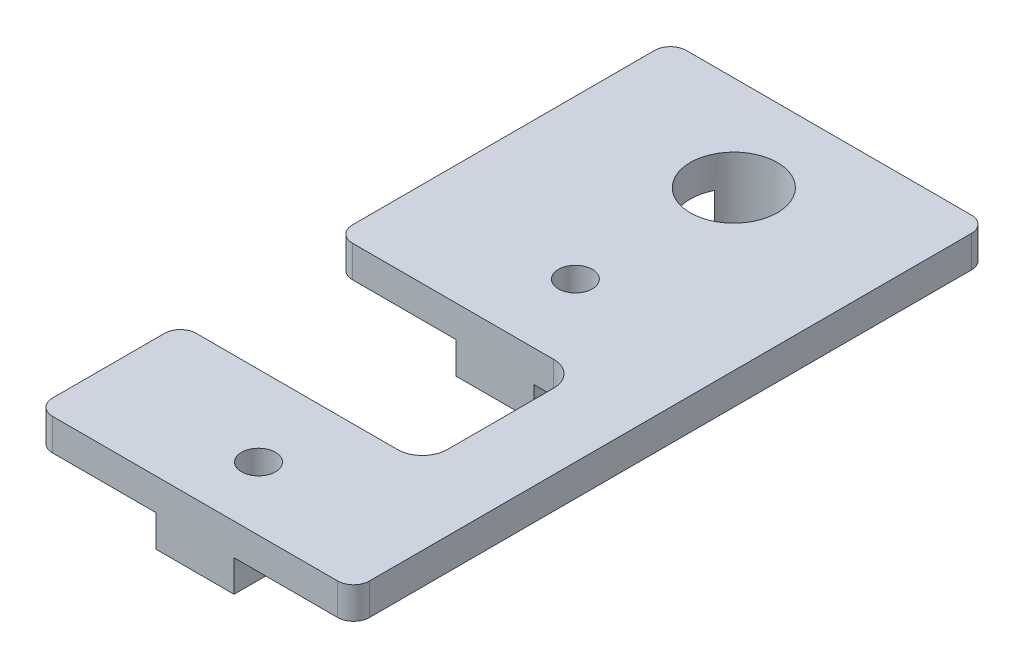
ISO-10303-21;
HEADER;
FILE_DESCRIPTION(('STEP AP214'),'2;1');
FILE_NAME('part.step','',(''),(''),'','','');
FILE_SCHEMA(('AUTOMOTIVE_DESIGN { 1 0 10303 214 1 1 1 1 }'));
ENDSEC;
DATA;
#1=APPLICATION_CONTEXT('core data for automotive mechanical design processes');
#2=APPLICATION_PROTOCOL_DEFINITION('international standard','automotive_design',2000,#1);
#3=PRODUCT_CONTEXT('',#1,'mechanical');
#4=PRODUCT('Part','Part','',(#3));
#5=PRODUCT_RELATED_PRODUCT_CATEGORY('part','',(#4));
#6=PRODUCT_DEFINITION_FORMATION('','',#4);
#7=PRODUCT_DEFINITION_CONTEXT('part definition',#1,'design');
#8=PRODUCT_DEFINITION('design','',#6,#7);
#9=PRODUCT_DEFINITION_SHAPE('','',#8);
#10=(LENGTH_UNIT() NAMED_UNIT(*) SI_UNIT(.MILLI.,.METRE.));
#11=(NAMED_UNIT(*) PLANE_ANGLE_UNIT() SI_UNIT($,.RADIAN.));
#12=(NAMED_UNIT(*) SI_UNIT($,.STERADIAN.) SOLID_ANGLE_UNIT());
#13=UNCERTAINTY_MEASURE_WITH_UNIT(LENGTH_MEASURE(1.E-05),#10,'distance_accuracy_value','');
#14=(GEOMETRIC_REPRESENTATION_CONTEXT(3) GLOBAL_UNCERTAINTY_ASSIGNED_CONTEXT((#13)) GLOBAL_UNIT_ASSIGNED_CONTEXT((#10,
#11,#12)) REPRESENTATION_CONTEXT('',''));
#15=CARTESIAN_POINT('',(0.,0.,0.));
#16=DIRECTION('',(0.,0.,1.));
#17=DIRECTION('',(1.,0.,0.));
#18=AXIS2_PLACEMENT_3D('',#15,#16,#17);
#19=CARTESIAN_POINT('',(-19.775,0.,63.5));
#20=DIRECTION('',(-1.,0.,0.));
#21=DIRECTION('',(0.,0.,-1.));
#22=AXIS2_PLACEMENT_3D('',#19,#20,#21);
#23=PLANE('',#22);
#24=DIRECTION('',(0.,1.,0.));
#25=VECTOR('',#24,1.);
#26=CARTESIAN_POINT('',(-19.775,-3.175,7.5631942908063));
#27=LINE('',#26,#25);
#28=CARTESIAN_POINT('',(-19.775,-3.175,7.5631942908063));
#29=VERTEX_POINT('',#28);
#30=CARTESIAN_POINT('',(-19.775,0.,7.5631942908063));
#31=VERTEX_POINT('',#30);
#32=EDGE_CURVE('E299',#29,#31,#27,.T.);
#33=ORIENTED_EDGE('',*,*,#32,.T.);
#34=DIRECTION('',(0.,0.,-1.));
#35=VECTOR('',#34,1.);
#36=CARTESIAN_POINT('',(-19.775,0.,63.5));
#37=LINE('',#36,#35);
#38=CARTESIAN_POINT('',(-19.775,0.,0.));
#39=VERTEX_POINT('',#38);
#40=EDGE_CURVE('E361',#31,#39,#37,.T.);
#41=ORIENTED_EDGE('',*,*,#40,.T.);
#42=DIRECTION('',(0.,-1.,0.));
#43=VECTOR('',#42,1.);
#44=CARTESIAN_POINT('',(-19.775,0.,0.));
#45=LINE('',#44,#43);
#46=CARTESIAN_POINT('',(-19.775,-3.175,0.));
#47=VERTEX_POINT('',#46);
#48=EDGE_CURVE('E302',#39,#47,#45,.T.);
#49=ORIENTED_EDGE('',*,*,#48,.T.);
#50=DIRECTION('',(0.,0.,-1.));
#51=VECTOR('',#50,1.);
#52=CARTESIAN_POINT('',(-19.775,-3.175,63.5));
#53=LINE('',#52,#51);
#54=EDGE_CURVE('E319',#29,#47,#53,.T.);
#55=ORIENTED_EDGE('',*,*,#54,.F.);
#56=EDGE_LOOP('',(#33,#41,#49,#55));
#57=FACE_BOUND('',#56,.T.);
#58=ADVANCED_FACE('F37',(#57),#23,.T.);
#59=CARTESIAN_POINT('',(-19.775,-3.175,63.5));
#60=VERTEX_POINT('',#59);
#61=CARTESIAN_POINT('',(-19.775,-3.175,49.1));
#62=VERTEX_POINT('',#61);
#63=EDGE_CURVE('E333',#60,#62,#53,.T.);
#64=ORIENTED_EDGE('',*,*,#63,.F.);
#65=DIRECTION('',(0.,-1.,0.));
#66=VECTOR('',#65,1.);
#67=CARTESIAN_POINT('',(-19.775,0.,63.5));
#68=LINE('',#67,#66);
#69=CARTESIAN_POINT('',(-19.775,0.,63.5));
#70=VERTEX_POINT('',#69);
#71=EDGE_CURVE('E303',#70,#60,#68,.T.);
#72=ORIENTED_EDGE('',*,*,#71,.F.);
#73=CARTESIAN_POINT('',(-19.775,0.,49.1));
#74=VERTEX_POINT('',#73);
#75=EDGE_CURVE('E362',#70,#74,#37,.T.);
#76=ORIENTED_EDGE('',*,*,#75,.T.);
#77=DIRECTION('',(0.,1.,0.));
#78=VECTOR('',#77,1.);
#79=CARTESIAN_POINT('',(-19.775,0.,49.1));
#80=LINE('',#79,#78);
#81=EDGE_CURVE('E272',#62,#74,#80,.T.);
#82=ORIENTED_EDGE('',*,*,#81,.F.);
#83=EDGE_LOOP('',(#64,#72,#76,#82));
#84=FACE_BOUND('',#83,.T.);
#85=ADVANCED_FACE('F478',(#84),#23,.T.);
#86=CARTESIAN_POINT('',(0.,0.,63.5));
#87=DIRECTION('',(0.,1.,0.));
#88=DIRECTION('',(0.,0.,1.));
#89=AXIS2_PLACEMENT_3D('',#86,#87,#88);
#90=PLANE('',#89);
#91=DIRECTION('',(1.,0.,0.));
#92=VECTOR('',#91,1.);
#93=CARTESIAN_POINT('',(0.,0.,49.1));
#94=LINE('',#93,#92);
#95=CARTESIAN_POINT('',(-30.1625,0.,49.1));
#96=VERTEX_POINT('',#95);
#97=EDGE_CURVE('E270',#96,#74,#94,.T.);
#98=ORIENTED_EDGE('',*,*,#97,.T.);
#99=ORIENTED_EDGE('',*,*,#75,.F.);
#100=DIRECTION('',(-1.,0.,0.));
#101=VECTOR('',#100,1.);
#102=CARTESIAN_POINT('',(0.,0.,63.5));
#103=LINE('',#102,#101);
#104=CARTESIAN_POINT('',(-30.1625,0.,63.5));
#105=VERTEX_POINT('',#104);
#106=EDGE_CURVE('E306',#70,#105,#103,.T.);
#107=ORIENTED_EDGE('',*,*,#106,.T.);
#108=CARTESIAN_POINT('',(-30.1625,0.,61.9125));
#109=DIRECTION('',(0.,-1.,0.));
#110=DIRECTION('',(0.,0.,1.));
#111=AXIS2_PLACEMENT_3D('',#108,#109,#110);
#112=CIRCLE('',#111,1.5875);
#113=CARTESIAN_POINT('',(-31.75,0.,61.9125));
#114=VERTEX_POINT('',#113);
#115=EDGE_CURVE('E415',#114,#105,#112,.F.);
#116=ORIENTED_EDGE('',*,*,#115,.F.);
#117=DIRECTION('',(0.,0.,-1.));
#118=VECTOR('',#117,1.);
#119=CARTESIAN_POINT('',(-31.75,0.,63.5));
#120=LINE('',#119,#118);
#121=CARTESIAN_POINT('',(-31.75,0.,50.6875));
#122=VERTEX_POINT('',#121);
#123=EDGE_CURVE('E358',#114,#122,#120,.T.);
#124=ORIENTED_EDGE('',*,*,#123,.T.);
#125=CARTESIAN_POINT('',(-30.1625,0.,50.6875));
#126=DIRECTION('',(0.,-1.,0.));
#127=DIRECTION('',(0.,0.,1.));
#128=AXIS2_PLACEMENT_3D('',#125,#126,#127);
#129=CIRCLE('',#128,1.5875);
#130=EDGE_CURVE('E418',#96,#122,#129,.F.);
#131=ORIENTED_EDGE('',*,*,#130,.F.);
#132=EDGE_LOOP('',(#98,#99,#107,#116,#124,#131));
#133=FACE_BOUND('',#132,.T.);
#134=ADVANCED_FACE('F475',(#133),#90,.F.);
#135=CARTESIAN_POINT('',(-31.75,0.,63.5));
#136=DIRECTION('',(1.,0.,0.));
#137=DIRECTION('',(0.,0.,1.));
#138=AXIS2_PLACEMENT_3D('',#135,#136,#137);
#139=PLANE('',#138);
#140=ORIENTED_EDGE('',*,*,#123,.F.);
#141=DIRECTION('',(0.,1.,0.));
#142=VECTOR('',#141,1.);
#143=CARTESIAN_POINT('',(-31.75,0.,61.9125));
#144=LINE('',#143,#142);
#145=CARTESIAN_POINT('',(-31.75,3.175,61.9125));
#146=VERTEX_POINT('',#145);
#147=EDGE_CURVE('E408',#146,#114,#144,.F.);
#148=ORIENTED_EDGE('',*,*,#147,.F.);
#149=DIRECTION('',(0.,0.,-1.));
#150=VECTOR('',#149,1.);
#151=CARTESIAN_POINT('',(-31.75,3.175,63.5));
#152=LINE('',#151,#150);
#153=CARTESIAN_POINT('',(-31.75,3.175,50.6875));
#154=VERTEX_POINT('',#153);
#155=EDGE_CURVE('E354',#146,#154,#152,.T.);
#156=ORIENTED_EDGE('',*,*,#155,.T.);
#157=DIRECTION('',(0.,1.,0.));
#158=VECTOR('',#157,1.);
#159=CARTESIAN_POINT('',(-31.75,3.175,50.6875));
#160=LINE('',#159,#158);
#161=EDGE_CURVE('E410',#122,#154,#160,.T.);
#162=ORIENTED_EDGE('',*,*,#161,.F.);
#163=EDGE_LOOP('',(#140,#148,#156,#162));
#164=FACE_BOUND('',#163,.T.);
#165=ADVANCED_FACE('F467',(#164),#139,.F.);
#166=CARTESIAN_POINT('',(-11.975,0.,63.5));
#167=DIRECTION('',(-1.,0.,0.));
#168=DIRECTION('',(0.,0.,-1.));
#169=AXIS2_PLACEMENT_3D('',#166,#167,#168);
#170=PLANE('',#169);
#171=DIRECTION('',(0.,0.,-1.));
#172=VECTOR('',#171,1.);
#173=CARTESIAN_POINT('',(-11.975,-3.175,63.5));
#174=LINE('',#173,#172);
#175=CARTESIAN_POINT('',(-11.975,-3.175,7.5631942908063));
#176=VERTEX_POINT('',#175);
#177=CARTESIAN_POINT('',(-11.975,-3.175,0.));
#178=VERTEX_POINT('',#177);
#179=EDGE_CURVE('E336',#176,#178,#174,.T.);
#180=ORIENTED_EDGE('',*,*,#179,.T.);
#181=DIRECTION('',(0.,-1.,0.));
#182=VECTOR('',#181,1.);
#183=CARTESIAN_POINT('',(-11.975,0.,0.));
#184=LINE('',#183,#182);
#185=CARTESIAN_POINT('',(-11.975,0.,0.));
#186=VERTEX_POINT('',#185);
#187=EDGE_CURVE('E329',#186,#178,#184,.T.);
#188=ORIENTED_EDGE('',*,*,#187,.F.);
#189=DIRECTION('',(0.,0.,-1.));
#190=VECTOR('',#189,1.);
#191=CARTESIAN_POINT('',(-11.975,0.,63.5));
#192=LINE('',#191,#190);
#193=CARTESIAN_POINT('',(-11.975,0.,7.5631942908063));
#194=VERTEX_POINT('',#193);
#195=EDGE_CURVE('E341',#194,#186,#192,.T.);
#196=ORIENTED_EDGE('',*,*,#195,.F.);
#197=DIRECTION('',(0.,1.,0.));
#198=VECTOR('',#197,1.);
#199=CARTESIAN_POINT('',(-11.975,-3.175,7.5631942908063));
#200=LINE('',#199,#198);
#201=EDGE_CURVE('E291',#176,#194,#200,.T.);
#202=ORIENTED_EDGE('',*,*,#201,.F.);
#203=EDGE_LOOP('',(#180,#188,#196,#202));
#204=FACE_BOUND('',#203,.T.);
#205=ADVANCED_FACE('F663',(#204),#170,.F.);
#206=DIRECTION('',(0.,1.,0.));
#207=VECTOR('',#206,1.);
#208=CARTESIAN_POINT('',(-11.975,0.,49.1));
#209=LINE('',#208,#207);
#210=CARTESIAN_POINT('',(-11.975,-3.175,49.1));
#211=VERTEX_POINT('',#210);
#212=CARTESIAN_POINT('',(-11.975,0.,49.1));
#213=VERTEX_POINT('',#212);
#214=EDGE_CURVE('E261',#211,#213,#209,.T.);
#215=ORIENTED_EDGE('',*,*,#214,.T.);
#216=CARTESIAN_POINT('',(-11.975,0.,63.5));
#217=VERTEX_POINT('',#216);
#218=EDGE_CURVE('E343',#217,#213,#192,.T.);
#219=ORIENTED_EDGE('',*,*,#218,.F.);
#220=DIRECTION('',(0.,-1.,0.));
#221=VECTOR('',#220,1.);
#222=CARTESIAN_POINT('',(-11.975,0.,63.5));
#223=LINE('',#222,#221);
#224=CARTESIAN_POINT('',(-11.975,-3.175,63.5));
#225=VERTEX_POINT('',#224);
#226=EDGE_CURVE('E314',#217,#225,#223,.T.);
#227=ORIENTED_EDGE('',*,*,#226,.T.);
#228=EDGE_CURVE('E338',#225,#211,#174,.T.);
#229=ORIENTED_EDGE('',*,*,#228,.T.);
#230=EDGE_LOOP('',(#215,#219,#227,#229));
#231=FACE_BOUND('',#230,.T.);
#232=ADVANCED_FACE('F454',(#231),#170,.F.);
#233=CARTESIAN_POINT('',(0.,-3.175,63.5));
#234=DIRECTION('',(0.,1.,0.));
#235=DIRECTION('',(0.,0.,1.));
#236=AXIS2_PLACEMENT_3D('',#233,#234,#235);
#237=PLANE('',#236);
#238=ORIENTED_EDGE('',*,*,#54,.T.);
#239=DIRECTION('',(-1.,0.,0.));
#240=VECTOR('',#239,1.);
#241=CARTESIAN_POINT('',(0.,-3.175,0.));
#242=LINE('',#241,#240);
#243=EDGE_CURVE('E307',#178,#47,#242,.T.);
#244=ORIENTED_EDGE('',*,*,#243,.F.);
#245=ORIENTED_EDGE('',*,*,#179,.F.);
#246=CARTESIAN_POINT('',(-15.875,-3.175,9.525));
#247=DIRECTION('',(0.,-1.,0.));
#248=DIRECTION('',(0.,0.,1.));
#249=AXIS2_PLACEMENT_3D('',#246,#247,#248);
#250=CIRCLE('',#249,4.365625);
#251=EDGE_CURVE('E372',#29,#176,#250,.T.);
#252=ORIENTED_EDGE('',*,*,#251,.F.);
#253=EDGE_LOOP('',(#238,#244,#245,#252));
#254=FACE_BOUND('',#253,.T.);
#255=ADVANCED_FACE('F483',(#254),#237,.F.);
#256=CARTESIAN_POINT('',(-15.875,-3.175,57.15));
#257=DIRECTION('',(0.,-1.,0.));
#258=DIRECTION('',(0.,0.,1.));
#259=AXIS2_PLACEMENT_3D('',#256,#257,#258);
#260=CIRCLE('',#259,1.7);
#261=CARTESIAN_POINT('',(-15.875,-3.175,58.85));
#262=VERTEX_POINT('',#261);
#263=EDGE_CURVE('E252',#262,#262,#260,.T.);
#264=ORIENTED_EDGE('',*,*,#263,.F.);
#265=EDGE_LOOP('',(#264));
#266=FACE_BOUND('',#265,.T.);
#267=DIRECTION('',(1.,0.,0.));
#268=VECTOR('',#267,1.);
#269=CARTESIAN_POINT('',(0.,-3.175,49.1));
#270=LINE('',#269,#268);
#271=EDGE_CURVE('E365',#62,#211,#270,.T.);
#272=ORIENTED_EDGE('',*,*,#271,.T.);
#273=ORIENTED_EDGE('',*,*,#228,.F.);
#274=DIRECTION('',(-1.,0.,0.));
#275=VECTOR('',#274,1.);
#276=CARTESIAN_POINT('',(0.,-3.175,63.5));
#277=LINE('',#276,#275);
#278=EDGE_CURVE('E317',#225,#60,#277,.T.);
#279=ORIENTED_EDGE('',*,*,#278,.T.);
#280=ORIENTED_EDGE('',*,*,#63,.T.);
#281=EDGE_LOOP('',(#272,#273,#279,#280));
#282=FACE_BOUND('',#281,.T.);
#283=ADVANCED_FACE('F480',(#266,#282),#237,.F.);
#284=DIRECTION('',(0.,1.,0.));
#285=VECTOR('',#284,1.);
#286=CARTESIAN_POINT('',(-19.775,-3.175,11.4868057091937));
#287=LINE('',#286,#285);
#288=CARTESIAN_POINT('',(-19.775,0.,11.4868057091937));
#289=VERTEX_POINT('',#288);
#290=CARTESIAN_POINT('',(-19.775,-3.175,11.4868057091937));
#291=VERTEX_POINT('',#290);
#292=EDGE_CURVE('E296',#289,#291,#287,.F.);
#293=ORIENTED_EDGE('',*,*,#292,.T.);
#294=CARTESIAN_POINT('',(-19.775,-3.175,33.45));
#295=VERTEX_POINT('',#294);
#296=EDGE_CURVE('E337',#295,#291,#53,.T.);
#297=ORIENTED_EDGE('',*,*,#296,.F.);
#298=DIRECTION('',(0.,1.,0.));
#299=VECTOR('',#298,1.);
#300=CARTESIAN_POINT('',(-19.775,0.,33.45));
#301=LINE('',#300,#299);
#302=CARTESIAN_POINT('',(-19.775,0.,33.45));
#303=VERTEX_POINT('',#302);
#304=EDGE_CURVE('E282',#295,#303,#301,.T.);
#305=ORIENTED_EDGE('',*,*,#304,.T.);
#306=EDGE_CURVE('E366',#303,#289,#37,.T.);
#307=ORIENTED_EDGE('',*,*,#306,.T.);
#308=EDGE_LOOP('',(#293,#297,#305,#307));
#309=FACE_BOUND('',#308,.T.);
#310=ADVANCED_FACE('F482',(#309),#23,.T.);
#311=CARTESIAN_POINT('',(-31.75,0.,31.8625));
#312=VERTEX_POINT('',#311);
#313=CARTESIAN_POINT('',(-31.75,0.,1.5875));
#314=VERTEX_POINT('',#313);
#315=EDGE_CURVE('E357',#312,#314,#120,.T.);
#316=ORIENTED_EDGE('',*,*,#315,.T.);
#317=CARTESIAN_POINT('',(-30.1625,0.,1.5875));
#318=DIRECTION('',(0.,-1.,0.));
#319=DIRECTION('',(0.,0.,1.));
#320=AXIS2_PLACEMENT_3D('',#317,#318,#319);
#321=CIRCLE('',#320,1.5875);
#322=CARTESIAN_POINT('',(-30.1625,0.,0.));
#323=VERTEX_POINT('',#322);
#324=EDGE_CURVE('E402',#323,#314,#321,.F.);
#325=ORIENTED_EDGE('',*,*,#324,.F.);
#326=DIRECTION('',(-1.,0.,0.));
#327=VECTOR('',#326,1.);
#328=CARTESIAN_POINT('',(0.,0.,0.));
#329=LINE('',#328,#327);
#330=EDGE_CURVE('E322',#39,#323,#329,.T.);
#331=ORIENTED_EDGE('',*,*,#330,.F.);
#332=ORIENTED_EDGE('',*,*,#40,.F.);
#333=CARTESIAN_POINT('',(-15.875,0.,9.525));
#334=DIRECTION('',(0.,-1.,0.));
#335=DIRECTION('',(0.,0.,1.));
#336=AXIS2_PLACEMENT_3D('',#333,#334,#335);
#337=CIRCLE('',#336,4.365625);
#338=EDGE_CURVE('E294',#289,#31,#337,.T.);
#339=ORIENTED_EDGE('',*,*,#338,.F.);
#340=ORIENTED_EDGE('',*,*,#306,.F.);
#341=DIRECTION('',(1.,0.,0.));
#342=VECTOR('',#341,1.);
#343=CARTESIAN_POINT('',(0.,0.,33.45));
#344=LINE('',#343,#342);
#345=CARTESIAN_POINT('',(-30.1625,0.,33.45));
#346=VERTEX_POINT('',#345);
#347=EDGE_CURVE('E280',#346,#303,#344,.T.);
#348=ORIENTED_EDGE('',*,*,#347,.F.);
#349=CARTESIAN_POINT('',(-30.1625,0.,31.8625));
#350=DIRECTION('',(0.,-1.,0.));
#351=DIRECTION('',(0.,0.,1.));
#352=AXIS2_PLACEMENT_3D('',#349,#350,#351);
#353=CIRCLE('',#352,1.5875);
#354=EDGE_CURVE('E405',#312,#346,#353,.F.);
#355=ORIENTED_EDGE('',*,*,#354,.F.);
#356=EDGE_LOOP('',(#316,#325,#331,#332,#339,#340,#348,#355));
#357=FACE_BOUND('',#356,.T.);
#358=ADVANCED_FACE('F491',(#357),#90,.F.);
#359=CARTESIAN_POINT('',(-31.75,3.175,31.8625));
#360=VERTEX_POINT('',#359);
#361=CARTESIAN_POINT('',(-31.75,3.175,1.5875));
#362=VERTEX_POINT('',#361);
#363=EDGE_CURVE('E353',#360,#362,#152,.T.);
#364=ORIENTED_EDGE('',*,*,#363,.T.);
#365=DIRECTION('',(0.,1.,0.));
#366=VECTOR('',#365,1.);
#367=CARTESIAN_POINT('',(-31.75,0.,1.5875));
#368=LINE('',#367,#366);
#369=EDGE_CURVE('E397',#314,#362,#368,.T.);
#370=ORIENTED_EDGE('',*,*,#369,.F.);
#371=ORIENTED_EDGE('',*,*,#315,.F.);
#372=DIRECTION('',(0.,1.,0.));
#373=VECTOR('',#372,1.);
#374=CARTESIAN_POINT('',(-31.75,0.,31.8625));
#375=LINE('',#374,#373);
#376=EDGE_CURVE('E400',#360,#312,#375,.F.);
#377=ORIENTED_EDGE('',*,*,#376,.F.);
#378=EDGE_LOOP('',(#364,#370,#371,#377));
#379=FACE_BOUND('',#378,.T.);
#380=ADVANCED_FACE('F508',(#379),#139,.F.);
#381=CARTESIAN_POINT('',(0.,3.175,63.5));
#382=DIRECTION('',(0.,1.,0.));
#383=DIRECTION('',(0.,0.,1.));
#384=AXIS2_PLACEMENT_3D('',#381,#382,#383);
#385=PLANE('',#384);
#386=CARTESIAN_POINT('',(-15.875,3.175,57.15));
#387=DIRECTION('',(0.,-1.,0.));
#388=DIRECTION('',(0.,0.,1.));
#389=AXIS2_PLACEMENT_3D('',#386,#387,#388);
#390=CIRCLE('',#389,1.7);
#391=CARTESIAN_POINT('',(-15.875,3.175,58.85));
#392=VERTEX_POINT('',#391);
#393=EDGE_CURVE('E803',#392,#392,#390,.T.);
#394=ORIENTED_EDGE('',*,*,#393,.T.);
#395=EDGE_LOOP('',(#394));
#396=FACE_BOUND('',#395,.T.);
#397=CARTESIAN_POINT('',(-15.875,3.175,9.525));
#398=DIRECTION('',(0.,-1.,0.));
#399=DIRECTION('',(0.,0.,1.));
#400=AXIS2_PLACEMENT_3D('',#397,#398,#399);
#401=CIRCLE('',#400,4.365625);
#402=CARTESIAN_POINT('',(-15.875,3.175,13.890625));
#403=VERTEX_POINT('',#402);
#404=EDGE_CURVE('E801',#403,#403,#401,.T.);
#405=ORIENTED_EDGE('',*,*,#404,.T.);
#406=EDGE_LOOP('',(#405));
#407=FACE_BOUND('',#406,.T.);
#408=CARTESIAN_POINT('',(-15.875,3.175,25.4));
#409=DIRECTION('',(0.,-1.,0.));
#410=DIRECTION('',(0.,0.,1.));
#411=AXIS2_PLACEMENT_3D('',#408,#409,#410);
#412=CIRCLE('',#411,1.7);
#413=CARTESIAN_POINT('',(-15.875,3.175,27.1));
#414=VERTEX_POINT('',#413);
#415=EDGE_CURVE('E246',#414,#414,#412,.T.);
#416=ORIENTED_EDGE('',*,*,#415,.T.);
#417=EDGE_LOOP('',(#416));
#418=FACE_BOUND('',#417,.T.);
#419=DIRECTION('',(1.,0.,0.));
#420=VECTOR('',#419,1.);
#421=CARTESIAN_POINT('',(0.,3.175,33.45));
#422=LINE('',#421,#420);
#423=CARTESIAN_POINT('',(-30.1625,3.175,33.45));
#424=VERTEX_POINT('',#423);
#425=CARTESIAN_POINT('',(-10.,3.175,33.45));
#426=VERTEX_POINT('',#425);
#427=EDGE_CURVE('E256',#424,#426,#422,.T.);
#428=ORIENTED_EDGE('',*,*,#427,.T.);
#429=CARTESIAN_POINT('',(-10.,3.175,35.95));
#430=DIRECTION('',(0.,-1.,0.));
#431=DIRECTION('',(0.,0.,1.));
#432=AXIS2_PLACEMENT_3D('',#429,#430,#431);
#433=CIRCLE('',#432,2.5);
#434=CARTESIAN_POINT('',(-7.5,3.175,35.95));
#435=VERTEX_POINT('',#434);
#436=EDGE_CURVE('E233',#426,#435,#433,.T.);
#437=ORIENTED_EDGE('',*,*,#436,.T.);
#438=DIRECTION('',(0.,0.,1.));
#439=VECTOR('',#438,1.);
#440=CARTESIAN_POINT('',(-7.5,3.175,0.));
#441=LINE('',#440,#439);
#442=CARTESIAN_POINT('',(-7.5,3.175,46.6));
#443=VERTEX_POINT('',#442);
#444=EDGE_CURVE('E225',#435,#443,#441,.T.);
#445=ORIENTED_EDGE('',*,*,#444,.T.);
#446=CARTESIAN_POINT('',(-10.,3.175,46.6));
#447=DIRECTION('',(0.,-1.,0.));
#448=DIRECTION('',(0.,0.,1.));
#449=AXIS2_PLACEMENT_3D('',#446,#447,#448);
#450=CIRCLE('',#449,2.5);
#451=CARTESIAN_POINT('',(-10.,3.175,49.1));
#452=VERTEX_POINT('',#451);
#453=EDGE_CURVE('E236',#443,#452,#450,.T.);
#454=ORIENTED_EDGE('',*,*,#453,.T.);
#455=DIRECTION('',(1.,0.,0.));
#456=VECTOR('',#455,1.);
#457=CARTESIAN_POINT('',(0.,3.175,49.1));
#458=LINE('',#457,#456);
#459=CARTESIAN_POINT('',(-30.1625,3.175,49.1));
#460=VERTEX_POINT('',#459);
#461=EDGE_CURVE('E241',#460,#452,#458,.T.);
#462=ORIENTED_EDGE('',*,*,#461,.F.);
#463=CARTESIAN_POINT('',(-30.1625,3.175,50.6875));
#464=DIRECTION('',(0.,-1.,0.));
#465=DIRECTION('',(0.,0.,1.));
#466=AXIS2_PLACEMENT_3D('',#463,#464,#465);
#467=CIRCLE('',#466,1.5875);
#468=EDGE_CURVE('E392',#154,#460,#467,.T.);
#469=ORIENTED_EDGE('',*,*,#468,.F.);
#470=ORIENTED_EDGE('',*,*,#155,.F.);
#471=CARTESIAN_POINT('',(-30.1625,3.175,61.9125));
#472=DIRECTION('',(0.,-1.,0.));
#473=DIRECTION('',(0.,0.,1.));
#474=AXIS2_PLACEMENT_3D('',#471,#472,#473);
#475=CIRCLE('',#474,1.5875);
#476=CARTESIAN_POINT('',(-30.1625,3.175,63.5));
#477=VERTEX_POINT('',#476);
#478=EDGE_CURVE('E387',#477,#146,#475,.T.);
#479=ORIENTED_EDGE('',*,*,#478,.F.);
#480=DIRECTION('',(-1.,0.,0.));
#481=VECTOR('',#480,1.);
#482=CARTESIAN_POINT('',(0.,3.175,63.5));
#483=LINE('',#482,#481);
#484=CARTESIAN_POINT('',(-1.5875,3.175,63.5));
#485=VERTEX_POINT('',#484);
#486=EDGE_CURVE('E310',#485,#477,#483,.T.);
#487=ORIENTED_EDGE('',*,*,#486,.F.);
#488=CARTESIAN_POINT('',(-1.5875,3.175,61.9125));
#489=DIRECTION('',(0.,-1.,0.));
#490=DIRECTION('',(0.,0.,1.));
#491=AXIS2_PLACEMENT_3D('',#488,#489,#490);
#492=CIRCLE('',#491,1.5875);
#493=CARTESIAN_POINT('',(0.,3.175,61.9125));
#494=VERTEX_POINT('',#493);
#495=EDGE_CURVE('E384',#494,#485,#492,.T.);
#496=ORIENTED_EDGE('',*,*,#495,.F.);
#497=DIRECTION('',(0.,0.,-1.));
#498=VECTOR('',#497,1.);
#499=CARTESIAN_POINT('',(0.,3.175,63.5));
#500=LINE('',#499,#498);
#501=CARTESIAN_POINT('',(0.,3.175,1.5875));
#502=VERTEX_POINT('',#501);
#503=EDGE_CURVE('E350',#494,#502,#500,.T.);
#504=ORIENTED_EDGE('',*,*,#503,.T.);
#505=CARTESIAN_POINT('',(-1.5875,3.175,1.5875));
#506=DIRECTION('',(0.,-1.,0.));
#507=DIRECTION('',(0.,0.,1.));
#508=AXIS2_PLACEMENT_3D('',#505,#506,#507);
#509=CIRCLE('',#508,1.5875);
#510=CARTESIAN_POINT('',(-1.5875,3.175,0.));
#511=VERTEX_POINT('',#510);
#512=EDGE_CURVE('E381',#511,#502,#509,.T.);
#513=ORIENTED_EDGE('',*,*,#512,.F.);
#514=DIRECTION('',(-1.,0.,0.));
#515=VECTOR('',#514,1.);
#516=CARTESIAN_POINT('',(0.,3.175,0.));
#517=LINE('',#516,#515);
#518=CARTESIAN_POINT('',(-30.1625,3.175,0.));
#519=VERTEX_POINT('',#518);
#520=EDGE_CURVE('E325',#511,#519,#517,.T.);
#521=ORIENTED_EDGE('',*,*,#520,.T.);
#522=CARTESIAN_POINT('',(-30.1625,3.175,1.5875));
#523=DIRECTION('',(0.,-1.,0.));
#524=DIRECTION('',(0.,0.,1.));
#525=AXIS2_PLACEMENT_3D('',#522,#523,#524);
#526=CIRCLE('',#525,1.5875);
#527=EDGE_CURVE('E389',#362,#519,#526,.T.);
#528=ORIENTED_EDGE('',*,*,#527,.F.);
#529=ORIENTED_EDGE('',*,*,#363,.F.);
#530=CARTESIAN_POINT('',(-30.1625,3.175,31.8625));
#531=DIRECTION('',(0.,-1.,0.));
#532=DIRECTION('',(0.,0.,1.));
#533=AXIS2_PLACEMENT_3D('',#530,#531,#532);
#534=CIRCLE('',#533,1.5875);
#535=EDGE_CURVE('E395',#424,#360,#534,.T.);
#536=ORIENTED_EDGE('',*,*,#535,.F.);
#537=EDGE_LOOP('',(#428,#437,#445,#454,#462,#469,#470,#479,#487,#496,#504,#513,#521,#528,#529,#536));
#538=FACE_BOUND('',#537,.T.);
#539=ADVANCED_FACE('F244',(#396,#407,#418,#538),#385,.T.);
#540=CARTESIAN_POINT('',(0.,0.,63.5));
#541=DIRECTION('',(1.,0.,0.));
#542=DIRECTION('',(0.,0.,1.));
#543=AXIS2_PLACEMENT_3D('',#540,#541,#542);
#544=PLANE('',#543);
#545=DIRECTION('',(0.,0.,-1.));
#546=VECTOR('',#545,1.);
#547=CARTESIAN_POINT('',(0.,0.,63.5));
#548=LINE('',#547,#546);
#549=CARTESIAN_POINT('',(0.,0.,61.9125));
#550=VERTEX_POINT('',#549);
#551=CARTESIAN_POINT('',(0.,0.,1.5875));
#552=VERTEX_POINT('',#551);
#553=EDGE_CURVE('E346',#550,#552,#548,.T.);
#554=ORIENTED_EDGE('',*,*,#553,.T.);
#555=DIRECTION('',(0.,1.,0.));
#556=VECTOR('',#555,1.);
#557=CARTESIAN_POINT('',(0.,0.,1.5875));
#558=LINE('',#557,#556);
#559=EDGE_CURVE('E429',#502,#552,#558,.F.);
#560=ORIENTED_EDGE('',*,*,#559,.F.);
#561=ORIENTED_EDGE('',*,*,#503,.F.);
#562=DIRECTION('',(0.,1.,0.));
#563=VECTOR('',#562,1.);
#564=CARTESIAN_POINT('',(0.,0.,61.9125));
#565=LINE('',#564,#563);
#566=EDGE_CURVE('E431',#550,#494,#565,.T.);
#567=ORIENTED_EDGE('',*,*,#566,.F.);
#568=EDGE_LOOP('',(#554,#560,#561,#567));
#569=FACE_BOUND('',#568,.T.);
#570=ADVANCED_FACE('F446',(#569),#544,.T.);
#571=CARTESIAN_POINT('',(-1.5875,0.,63.5));
#572=VERTEX_POINT('',#571);
#573=EDGE_CURVE('E311',#572,#217,#103,.T.);
#574=ORIENTED_EDGE('',*,*,#573,.T.);
#575=ORIENTED_EDGE('',*,*,#218,.T.);
#576=DIRECTION('',(1.,0.,0.));
#577=VECTOR('',#576,1.);
#578=CARTESIAN_POINT('',(0.,0.,49.1));
#579=LINE('',#578,#577);
#580=CARTESIAN_POINT('',(-10.,0.,49.1));
#581=VERTEX_POINT('',#580);
#582=EDGE_CURVE('E267',#213,#581,#579,.T.);
#583=ORIENTED_EDGE('',*,*,#582,.T.);
#584=CARTESIAN_POINT('',(-10.,0.,46.6));
#585=DIRECTION('',(0.,-1.,0.));
#586=DIRECTION('',(0.,0.,1.));
#587=AXIS2_PLACEMENT_3D('',#584,#585,#586);
#588=CIRCLE('',#587,2.5);
#589=CARTESIAN_POINT('',(-7.5,0.,46.6));
#590=VERTEX_POINT('',#589);
#591=EDGE_CURVE('E373',#590,#581,#588,.T.);
#592=ORIENTED_EDGE('',*,*,#591,.F.);
#593=DIRECTION('',(0.,0.,1.));
#594=VECTOR('',#593,1.);
#595=CARTESIAN_POINT('',(-7.5,0.,63.5));
#596=LINE('',#595,#594);
#597=CARTESIAN_POINT('',(-7.5,0.,35.95));
#598=VERTEX_POINT('',#597);
#599=EDGE_CURVE('E228',#598,#590,#596,.T.);
#600=ORIENTED_EDGE('',*,*,#599,.F.);
#601=CARTESIAN_POINT('',(-10.,0.,35.95));
#602=DIRECTION('',(0.,-1.,0.));
#603=DIRECTION('',(0.,0.,1.));
#604=AXIS2_PLACEMENT_3D('',#601,#602,#603);
#605=CIRCLE('',#604,2.5);
#606=CARTESIAN_POINT('',(-10.,0.,33.45));
#607=VERTEX_POINT('',#606);
#608=EDGE_CURVE('E376',#607,#598,#605,.T.);
#609=ORIENTED_EDGE('',*,*,#608,.F.);
#610=DIRECTION('',(1.,0.,0.));
#611=VECTOR('',#610,1.);
#612=CARTESIAN_POINT('',(0.,0.,33.45));
#613=LINE('',#612,#611);
#614=CARTESIAN_POINT('',(-11.975,0.,33.45));
#615=VERTEX_POINT('',#614);
#616=EDGE_CURVE('E277',#615,#607,#613,.T.);
#617=ORIENTED_EDGE('',*,*,#616,.F.);
#618=CARTESIAN_POINT('',(-11.975,0.,11.4868057091937));
#619=VERTEX_POINT('',#618);
#620=EDGE_CURVE('E347',#615,#619,#192,.T.);
#621=ORIENTED_EDGE('',*,*,#620,.T.);
#622=CARTESIAN_POINT('',(-15.875,0.,9.525));
#623=DIRECTION('',(0.,-1.,0.));
#624=DIRECTION('',(0.,0.,1.));
#625=AXIS2_PLACEMENT_3D('',#622,#623,#624);
#626=CIRCLE('',#625,4.365625);
#627=EDGE_CURVE('E288',#194,#619,#626,.T.);
#628=ORIENTED_EDGE('',*,*,#627,.F.);
#629=ORIENTED_EDGE('',*,*,#195,.T.);
#630=CARTESIAN_POINT('',(-1.5875,0.,0.));
#631=VERTEX_POINT('',#630);
#632=EDGE_CURVE('E326',#631,#186,#329,.T.);
#633=ORIENTED_EDGE('',*,*,#632,.F.);
#634=CARTESIAN_POINT('',(-1.5875,0.,1.5875));
#635=DIRECTION('',(0.,-1.,0.));
#636=DIRECTION('',(0.,0.,1.));
#637=AXIS2_PLACEMENT_3D('',#634,#635,#636);
#638=CIRCLE('',#637,1.5875);
#639=EDGE_CURVE('E45',#552,#631,#638,.F.);
#640=ORIENTED_EDGE('',*,*,#639,.F.);
#641=ORIENTED_EDGE('',*,*,#553,.F.);
#642=CARTESIAN_POINT('',(-1.5875,0.,61.9125));
#643=DIRECTION('',(0.,-1.,0.));
#644=DIRECTION('',(0.,0.,1.));
#645=AXIS2_PLACEMENT_3D('',#642,#643,#644);
#646=CIRCLE('',#645,1.5875);
#647=EDGE_CURVE('E11',#572,#550,#646,.F.);
#648=ORIENTED_EDGE('',*,*,#647,.F.);
#649=EDGE_LOOP('',(#574,#575,#583,#592,#600,#609,#617,#621,#628,#629,#633,#640,#641,#648));
#650=FACE_BOUND('',#649,.T.);
#651=ADVANCED_FACE('F435',(#650),#90,.F.);
#652=ORIENTED_EDGE('',*,*,#620,.F.);
#653=DIRECTION('',(0.,1.,0.));
#654=VECTOR('',#653,1.);
#655=CARTESIAN_POINT('',(-11.975,0.,33.45));
#656=LINE('',#655,#654);
#657=CARTESIAN_POINT('',(-11.975,-3.175,33.45));
#658=VERTEX_POINT('',#657);
#659=EDGE_CURVE('E275',#658,#615,#656,.T.);
#660=ORIENTED_EDGE('',*,*,#659,.F.);
#661=CARTESIAN_POINT('',(-11.975,-3.175,11.4868057091937));
#662=VERTEX_POINT('',#661);
#663=EDGE_CURVE('E342',#658,#662,#174,.T.);
#664=ORIENTED_EDGE('',*,*,#663,.T.);
#665=DIRECTION('',(0.,1.,0.));
#666=VECTOR('',#665,1.);
#667=CARTESIAN_POINT('',(-11.975,-3.175,11.4868057091937));
#668=LINE('',#667,#666);
#669=EDGE_CURVE('E285',#619,#662,#668,.F.);
#670=ORIENTED_EDGE('',*,*,#669,.F.);
#671=EDGE_LOOP('',(#652,#660,#664,#670));
#672=FACE_BOUND('',#671,.T.);
#673=ADVANCED_FACE('F499',(#672),#170,.F.);
#674=CARTESIAN_POINT('',(-15.875,-3.175,25.4));
#675=DIRECTION('',(0.,-1.,0.));
#676=DIRECTION('',(0.,0.,1.));
#677=AXIS2_PLACEMENT_3D('',#674,#675,#676);
#678=CIRCLE('',#677,1.7);
#679=CARTESIAN_POINT('',(-15.875,-3.175,27.1));
#680=VERTEX_POINT('',#679);
#681=EDGE_CURVE('E249',#680,#680,#678,.T.);
#682=ORIENTED_EDGE('',*,*,#681,.F.);
#683=EDGE_LOOP('',(#682));
#684=FACE_BOUND('',#683,.T.);
#685=ORIENTED_EDGE('',*,*,#663,.F.);
#686=DIRECTION('',(1.,0.,0.));
#687=VECTOR('',#686,1.);
#688=CARTESIAN_POINT('',(0.,-3.175,33.45));
#689=LINE('',#688,#687);
#690=EDGE_CURVE('E368',#295,#658,#689,.T.);
#691=ORIENTED_EDGE('',*,*,#690,.F.);
#692=ORIENTED_EDGE('',*,*,#296,.T.);
#693=EDGE_CURVE('E370',#662,#291,#250,.T.);
#694=ORIENTED_EDGE('',*,*,#693,.F.);
#695=EDGE_LOOP('',(#685,#691,#692,#694));
#696=FACE_BOUND('',#695,.T.);
#697=ADVANCED_FACE('F486',(#684,#696),#237,.F.);
#698=CARTESIAN_POINT('',(0.,0.,63.5));
#699=DIRECTION('',(0.,0.,1.));
#700=DIRECTION('',(-1.,0.,0.));
#701=AXIS2_PLACEMENT_3D('',#698,#699,#700);
#702=PLANE('',#701);
#703=ORIENTED_EDGE('',*,*,#106,.F.);
#704=ORIENTED_EDGE('',*,*,#71,.T.);
#705=ORIENTED_EDGE('',*,*,#278,.F.);
#706=ORIENTED_EDGE('',*,*,#226,.F.);
#707=ORIENTED_EDGE('',*,*,#573,.F.);
#708=DIRECTION('',(0.,1.,0.));
#709=VECTOR('',#708,1.);
#710=CARTESIAN_POINT('',(-1.5875,0.,63.5));
#711=LINE('',#710,#709);
#712=EDGE_CURVE('E425',#485,#572,#711,.F.);
#713=ORIENTED_EDGE('',*,*,#712,.F.);
#714=ORIENTED_EDGE('',*,*,#486,.T.);
#715=DIRECTION('',(0.,1.,0.));
#716=VECTOR('',#715,1.);
#717=CARTESIAN_POINT('',(-30.1625,3.175,63.5));
#718=LINE('',#717,#716);
#719=EDGE_CURVE('E427',#105,#477,#718,.T.);
#720=ORIENTED_EDGE('',*,*,#719,.F.);
#721=EDGE_LOOP('',(#703,#704,#705,#706,#707,#713,#714,#720));
#722=FACE_BOUND('',#721,.T.);
#723=ADVANCED_FACE('F450',(#722),#702,.T.);
#724=CARTESIAN_POINT('',(0.,0.,0.));
#725=DIRECTION('',(0.,0.,1.));
#726=DIRECTION('',(-1.,0.,0.));
#727=AXIS2_PLACEMENT_3D('',#724,#725,#726);
#728=PLANE('',#727);
#729=ORIENTED_EDGE('',*,*,#520,.F.);
#730=DIRECTION('',(0.,1.,0.));
#731=VECTOR('',#730,1.);
#732=CARTESIAN_POINT('',(-1.5875,3.175,0.));
#733=LINE('',#732,#731);
#734=EDGE_CURVE('E421',#631,#511,#733,.T.);
#735=ORIENTED_EDGE('',*,*,#734,.F.);
#736=ORIENTED_EDGE('',*,*,#632,.T.);
#737=ORIENTED_EDGE('',*,*,#187,.T.);
#738=ORIENTED_EDGE('',*,*,#243,.T.);
#739=ORIENTED_EDGE('',*,*,#48,.F.);
#740=ORIENTED_EDGE('',*,*,#330,.T.);
#741=DIRECTION('',(0.,1.,0.));
#742=VECTOR('',#741,1.);
#743=CARTESIAN_POINT('',(-30.1625,0.,0.));
#744=LINE('',#743,#742);
#745=EDGE_CURVE('E423',#519,#323,#744,.F.);
#746=ORIENTED_EDGE('',*,*,#745,.F.);
#747=EDGE_LOOP('',(#729,#735,#736,#737,#738,#739,#740,#746));
#748=FACE_BOUND('',#747,.T.);
#749=ADVANCED_FACE('F439',(#748),#728,.F.);
#750=CARTESIAN_POINT('',(-7.5,-3.175,0.));
#751=DIRECTION('',(1.,0.,0.));
#752=DIRECTION('',(0.,0.,1.));
#753=AXIS2_PLACEMENT_3D('',#750,#751,#752);
#754=PLANE('',#753);
#755=DIRECTION('',(0.,1.,0.));
#756=VECTOR('',#755,1.);
#757=CARTESIAN_POINT('',(-7.5,-3.175,35.95));
#758=LINE('',#757,#756);
#759=EDGE_CURVE('E259',#598,#435,#758,.T.);
#760=ORIENTED_EDGE('',*,*,#759,.F.);
#761=ORIENTED_EDGE('',*,*,#599,.T.);
#762=DIRECTION('',(0.,1.,0.));
#763=VECTOR('',#762,1.);
#764=CARTESIAN_POINT('',(-7.5,-3.175,46.6));
#765=LINE('',#764,#763);
#766=EDGE_CURVE('E221',#590,#443,#765,.T.);
#767=ORIENTED_EDGE('',*,*,#766,.T.);
#768=ORIENTED_EDGE('',*,*,#444,.F.);
#769=EDGE_LOOP('',(#760,#761,#767,#768));
#770=FACE_BOUND('',#769,.T.);
#771=ADVANCED_FACE('F223',(#770),#754,.F.);
#772=CARTESIAN_POINT('',(-10.,-3.175,35.95));
#773=DIRECTION('',(0.,1.,0.));
#774=DIRECTION('',(0.,0.,1.));
#775=AXIS2_PLACEMENT_3D('',#772,#773,#774);
#776=CYLINDRICAL_SURFACE('',#775,2.5);
#777=DIRECTION('',(0.,1.,0.));
#778=VECTOR('',#777,1.);
#779=CARTESIAN_POINT('',(-10.,-3.175,33.45));
#780=LINE('',#779,#778);
#781=EDGE_CURVE('E262',#607,#426,#780,.T.);
#782=ORIENTED_EDGE('',*,*,#781,.F.);
#783=ORIENTED_EDGE('',*,*,#608,.T.);
#784=ORIENTED_EDGE('',*,*,#759,.T.);
#785=ORIENTED_EDGE('',*,*,#436,.F.);
#786=EDGE_LOOP('',(#782,#783,#784,#785));
#787=FACE_BOUND('',#786,.T.);
#788=ADVANCED_FACE('F613',(#787),#776,.F.);
#789=CARTESIAN_POINT('',(-10.,-3.175,46.6));
#790=DIRECTION('',(0.,1.,0.));
#791=DIRECTION('',(0.,0.,1.));
#792=AXIS2_PLACEMENT_3D('',#789,#790,#791);
#793=CYLINDRICAL_SURFACE('',#792,2.5);
#794=ORIENTED_EDGE('',*,*,#766,.F.);
#795=ORIENTED_EDGE('',*,*,#591,.T.);
#796=DIRECTION('',(0.,1.,0.));
#797=VECTOR('',#796,1.);
#798=CARTESIAN_POINT('',(-10.,-3.175,49.1));
#799=LINE('',#798,#797);
#800=EDGE_CURVE('E232',#581,#452,#799,.T.);
#801=ORIENTED_EDGE('',*,*,#800,.T.);
#802=ORIENTED_EDGE('',*,*,#453,.F.);
#803=EDGE_LOOP('',(#794,#795,#801,#802));
#804=FACE_BOUND('',#803,.T.);
#805=ADVANCED_FACE('F237',(#804),#793,.F.);
#806=CARTESIAN_POINT('',(0.,-3.175,33.45));
#807=DIRECTION('',(0.,0.,-1.));
#808=DIRECTION('',(1.,0.,0.));
#809=AXIS2_PLACEMENT_3D('',#806,#807,#808);
#810=PLANE('',#809);
#811=ORIENTED_EDGE('',*,*,#347,.T.);
#812=ORIENTED_EDGE('',*,*,#304,.F.);
#813=ORIENTED_EDGE('',*,*,#690,.T.);
#814=ORIENTED_EDGE('',*,*,#659,.T.);
#815=ORIENTED_EDGE('',*,*,#616,.T.);
#816=ORIENTED_EDGE('',*,*,#781,.T.);
#817=ORIENTED_EDGE('',*,*,#427,.F.);
#818=DIRECTION('',(0.,1.,0.));
#819=VECTOR('',#818,1.);
#820=CARTESIAN_POINT('',(-30.1625,-3.175,33.45));
#821=LINE('',#820,#819);
#822=EDGE_CURVE('E379',#346,#424,#821,.T.);
#823=ORIENTED_EDGE('',*,*,#822,.F.);
#824=EDGE_LOOP('',(#811,#812,#813,#814,#815,#816,#817,#823));
#825=FACE_BOUND('',#824,.T.);
#826=ADVANCED_FACE('F595',(#825),#810,.F.);
#827=CARTESIAN_POINT('',(0.,-3.175,49.1));
#828=DIRECTION('',(0.,0.,-1.));
#829=DIRECTION('',(1.,0.,0.));
#830=AXIS2_PLACEMENT_3D('',#827,#828,#829);
#831=PLANE('',#830);
#832=ORIENTED_EDGE('',*,*,#461,.T.);
#833=ORIENTED_EDGE('',*,*,#800,.F.);
#834=ORIENTED_EDGE('',*,*,#582,.F.);
#835=ORIENTED_EDGE('',*,*,#214,.F.);
#836=ORIENTED_EDGE('',*,*,#271,.F.);
#837=ORIENTED_EDGE('',*,*,#81,.T.);
#838=ORIENTED_EDGE('',*,*,#97,.F.);
#839=DIRECTION('',(0.,1.,0.));
#840=VECTOR('',#839,1.);
#841=CARTESIAN_POINT('',(-30.1625,0.,49.1));
#842=LINE('',#841,#840);
#843=EDGE_CURVE('E413',#460,#96,#842,.F.);
#844=ORIENTED_EDGE('',*,*,#843,.F.);
#845=EDGE_LOOP('',(#832,#833,#834,#835,#836,#837,#838,#844));
#846=FACE_BOUND('',#845,.T.);
#847=ADVANCED_FACE('F457',(#846),#831,.T.);
#848=CARTESIAN_POINT('',(-15.875,-3.175,25.4));
#849=DIRECTION('',(0.,1.,0.));
#850=DIRECTION('',(0.,0.,1.));
#851=AXIS2_PLACEMENT_3D('',#848,#849,#850);
#852=CYLINDRICAL_SURFACE('',#851,1.7);
#853=ORIENTED_EDGE('',*,*,#681,.T.);
#854=EDGE_LOOP('',(#853));
#855=FACE_BOUND('',#854,.T.);
#856=ORIENTED_EDGE('',*,*,#415,.F.);
#857=EDGE_LOOP('',(#856));
#858=FACE_BOUND('',#857,.T.);
#859=ADVANCED_FACE('F576',(#855,#858),#852,.F.);
#860=CARTESIAN_POINT('',(-15.875,-3.175,9.525));
#861=DIRECTION('',(0.,1.,0.));
#862=DIRECTION('',(0.,0.,1.));
#863=AXIS2_PLACEMENT_3D('',#860,#861,#862);
#864=CYLINDRICAL_SURFACE('',#863,4.365625);
#865=ORIENTED_EDGE('',*,*,#32,.F.);
#866=ORIENTED_EDGE('',*,*,#251,.T.);
#867=ORIENTED_EDGE('',*,*,#201,.T.);
#868=ORIENTED_EDGE('',*,*,#627,.T.);
#869=ORIENTED_EDGE('',*,*,#669,.T.);
#870=ORIENTED_EDGE('',*,*,#693,.T.);
#871=ORIENTED_EDGE('',*,*,#292,.F.);
#872=ORIENTED_EDGE('',*,*,#338,.T.);
#873=EDGE_LOOP('',(#865,#866,#867,#868,#869,#870,#871,#872));
#874=FACE_BOUND('',#873,.T.);
#875=ORIENTED_EDGE('',*,*,#404,.F.);
#876=EDGE_LOOP('',(#875));
#877=FACE_BOUND('',#876,.T.);
#878=ADVANCED_FACE('F566',(#874,#877),#864,.F.);
#879=CARTESIAN_POINT('',(-15.875,-3.175,57.15));
#880=DIRECTION('',(0.,1.,0.));
#881=DIRECTION('',(0.,0.,1.));
#882=AXIS2_PLACEMENT_3D('',#879,#880,#881);
#883=CYLINDRICAL_SURFACE('',#882,1.7);
#884=ORIENTED_EDGE('',*,*,#263,.T.);
#885=EDGE_LOOP('',(#884));
#886=FACE_BOUND('',#885,.T.);
#887=ORIENTED_EDGE('',*,*,#393,.F.);
#888=EDGE_LOOP('',(#887));
#889=FACE_BOUND('',#888,.T.);
#890=ADVANCED_FACE('F513',(#886,#889),#883,.F.);
#891=CARTESIAN_POINT('',(-30.1625,-3.175,31.8625));
#892=DIRECTION('',(0.,1.,0.));
#893=DIRECTION('',(0.,0.,1.));
#894=AXIS2_PLACEMENT_3D('',#891,#892,#893);
#895=CYLINDRICAL_SURFACE('',#894,1.5875);
#896=ORIENTED_EDGE('',*,*,#354,.T.);
#897=ORIENTED_EDGE('',*,*,#822,.T.);
#898=ORIENTED_EDGE('',*,*,#535,.T.);
#899=ORIENTED_EDGE('',*,*,#376,.T.);
#900=EDGE_LOOP('',(#896,#897,#898,#899));
#901=FACE_BOUND('',#900,.T.);
#902=ADVANCED_FACE('F510',(#901),#895,.T.);
#903=CARTESIAN_POINT('',(-30.1625,0.,50.6875));
#904=DIRECTION('',(0.,-1.,0.));
#905=DIRECTION('',(0.,0.,-1.));
#906=AXIS2_PLACEMENT_3D('',#903,#904,#905);
#907=CYLINDRICAL_SURFACE('',#906,1.5875);
#908=ORIENTED_EDGE('',*,*,#130,.T.);
#909=ORIENTED_EDGE('',*,*,#161,.T.);
#910=ORIENTED_EDGE('',*,*,#468,.T.);
#911=ORIENTED_EDGE('',*,*,#843,.T.);
#912=EDGE_LOOP('',(#908,#909,#910,#911));
#913=FACE_BOUND('',#912,.T.);
#914=ADVANCED_FACE('F463',(#913),#907,.T.);
#915=CARTESIAN_POINT('',(-30.1625,0.,1.5875));
#916=DIRECTION('',(0.,1.,0.));
#917=DIRECTION('',(0.,0.,1.));
#918=AXIS2_PLACEMENT_3D('',#915,#916,#917);
#919=CYLINDRICAL_SURFACE('',#918,1.5875);
#920=ORIENTED_EDGE('',*,*,#324,.T.);
#921=ORIENTED_EDGE('',*,*,#369,.T.);
#922=ORIENTED_EDGE('',*,*,#527,.T.);
#923=ORIENTED_EDGE('',*,*,#745,.T.);
#924=EDGE_LOOP('',(#920,#921,#922,#923));
#925=FACE_BOUND('',#924,.T.);
#926=ADVANCED_FACE('F517',(#925),#919,.T.);
#927=CARTESIAN_POINT('',(-30.1625,0.,61.9125));
#928=DIRECTION('',(0.,-1.,0.));
#929=DIRECTION('',(0.,0.,-1.));
#930=AXIS2_PLACEMENT_3D('',#927,#928,#929);
#931=CYLINDRICAL_SURFACE('',#930,1.5875);
#932=ORIENTED_EDGE('',*,*,#115,.T.);
#933=ORIENTED_EDGE('',*,*,#719,.T.);
#934=ORIENTED_EDGE('',*,*,#478,.T.);
#935=ORIENTED_EDGE('',*,*,#147,.T.);
#936=EDGE_LOOP('',(#932,#933,#934,#935));
#937=FACE_BOUND('',#936,.T.);
#938=ADVANCED_FACE('F470',(#937),#931,.T.);
#939=CARTESIAN_POINT('',(-1.5875,0.,61.9125));
#940=DIRECTION('',(0.,1.,0.));
#941=DIRECTION('',(0.,0.,1.));
#942=AXIS2_PLACEMENT_3D('',#939,#940,#941);
#943=CYLINDRICAL_SURFACE('',#942,1.5875);
#944=ORIENTED_EDGE('',*,*,#647,.T.);
#945=ORIENTED_EDGE('',*,*,#566,.T.);
#946=ORIENTED_EDGE('',*,*,#495,.T.);
#947=ORIENTED_EDGE('',*,*,#712,.T.);
#948=EDGE_LOOP('',(#944,#945,#946,#947));
#949=FACE_BOUND('',#948,.T.);
#950=ADVANCED_FACE('F522',(#949),#943,.T.);
#951=CARTESIAN_POINT('',(-1.5875,0.,1.5875));
#952=DIRECTION('',(0.,-1.,0.));
#953=DIRECTION('',(0.,0.,-1.));
#954=AXIS2_PLACEMENT_3D('',#951,#952,#953);
#955=CYLINDRICAL_SURFACE('',#954,1.5875);
#956=ORIENTED_EDGE('',*,*,#639,.T.);
#957=ORIENTED_EDGE('',*,*,#734,.T.);
#958=ORIENTED_EDGE('',*,*,#512,.T.);
#959=ORIENTED_EDGE('',*,*,#559,.T.);
#960=EDGE_LOOP('',(#956,#957,#958,#959));
#961=FACE_BOUND('',#960,.T.);
#962=ADVANCED_FACE('F39',(#961),#955,.T.);
#963=CLOSED_SHELL('',(#58,#85,#134,#165,#205,#232,#255,#283,#310,#358,#380,#539,#570,#651,#673,
#697,#723,#749,#771,#788,#805,#826,#847,#859,#878,#890,#902,#914,#926,#938,#950,#962));
#964=MANIFOLD_SOLID_BREP('B2',#963);
#965=ADVANCED_BREP_SHAPE_REPRESENTATION('',(#18,#964),#14);
#966=SHAPE_DEFINITION_REPRESENTATION(#9,#965);
ENDSEC;
END-ISO-10303-21;
